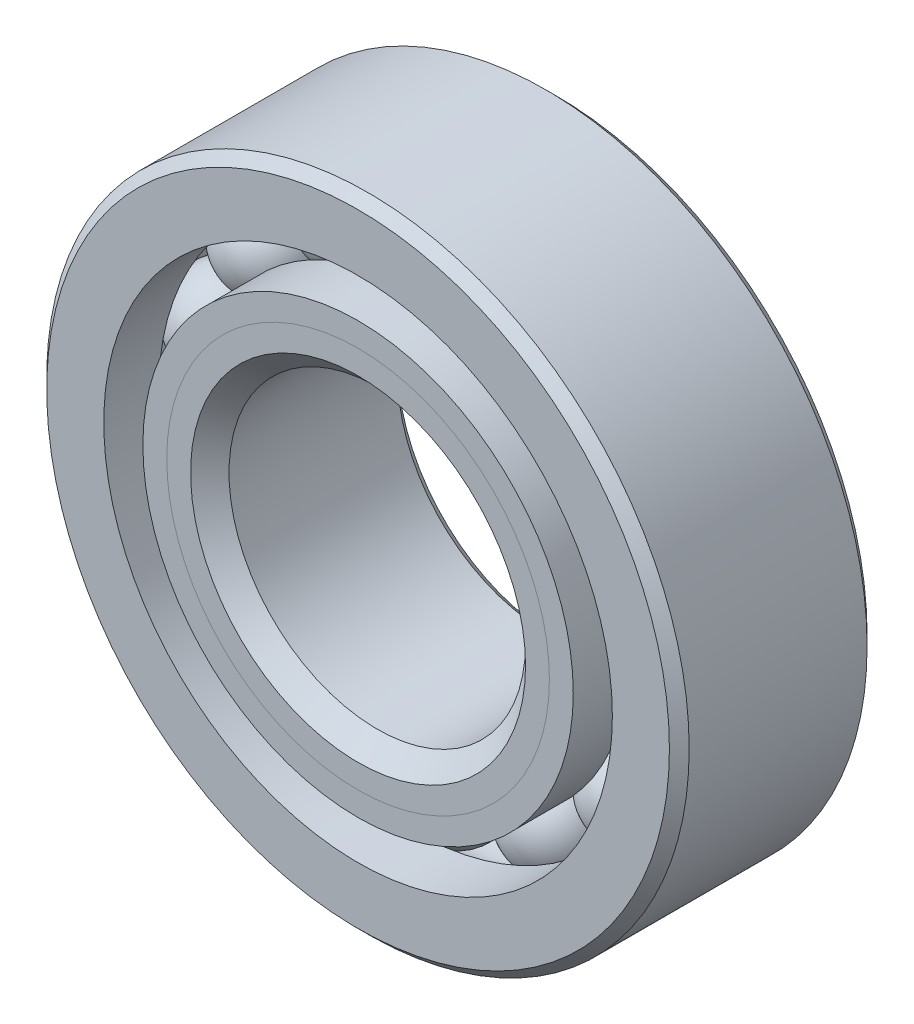
ISO-10303-21;
HEADER;
FILE_DESCRIPTION(('STEP AP214'),'2;1');
FILE_NAME('part.step','',(''),(''),'','','');
FILE_SCHEMA(('AUTOMOTIVE_DESIGN { 1 0 10303 214 1 1 1 1 }'));
ENDSEC;
DATA;
#1=APPLICATION_CONTEXT('core data for automotive mechanical design processes');
#2=APPLICATION_PROTOCOL_DEFINITION('international standard','automotive_design',2000,#1);
#3=PRODUCT_CONTEXT('',#1,'mechanical');
#4=PRODUCT('Part','Part','',(#3));
#5=PRODUCT_RELATED_PRODUCT_CATEGORY('part','',(#4));
#6=PRODUCT_DEFINITION_FORMATION('','',#4);
#7=PRODUCT_DEFINITION_CONTEXT('part definition',#1,'design');
#8=PRODUCT_DEFINITION('design','',#6,#7);
#9=PRODUCT_DEFINITION_SHAPE('','',#8);
#10=(LENGTH_UNIT() NAMED_UNIT(*) SI_UNIT(.MILLI.,.METRE.));
#11=(NAMED_UNIT(*) PLANE_ANGLE_UNIT() SI_UNIT($,.RADIAN.));
#12=(NAMED_UNIT(*) SI_UNIT($,.STERADIAN.) SOLID_ANGLE_UNIT());
#13=UNCERTAINTY_MEASURE_WITH_UNIT(LENGTH_MEASURE(1.E-05),#10,'distance_accuracy_value','');
#14=(GEOMETRIC_REPRESENTATION_CONTEXT(3) GLOBAL_UNCERTAINTY_ASSIGNED_CONTEXT((#13)) GLOBAL_UNIT_ASSIGNED_CONTEXT((#10,
#11,#12)) REPRESENTATION_CONTEXT('',''));
#15=CARTESIAN_POINT('',(0.,0.,0.));
#16=DIRECTION('',(0.,0.,1.));
#17=DIRECTION('',(1.,0.,0.));
#18=AXIS2_PLACEMENT_3D('',#15,#16,#17);
#19=CARTESIAN_POINT('',(-6.5435091405665,13.5877367390534,0.));
#20=DIRECTION('',(0.,0.,1.));
#21=DIRECTION('',(-0.433883739117546,0.900968867902425,0.));
#22=AXIS2_PLACEMENT_3D('',#19,#20,#21);
#23=SPHERICAL_SURFACE('',#22,3.08910742628344);
#24=CARTESIAN_POINT('',(-6.5435091405665,13.5877367390534,3.08910742628344));
#25=VERTEX_POINT('',#24);
#26=VERTEX_LOOP('',#25);
#27=FACE_BOUND('',#26,.T.);
#28=ADVANCED_FACE('F41',(#27),#23,.T.);
#29=CLOSED_SHELL('',(#28));
#30=MANIFOLD_SOLID_BREP('B2',#29);
#31=CARTESIAN_POINT('',(-11.7909960449709,9.40300557428217,0.));
#32=DIRECTION('',(0.,0.,1.));
#33=DIRECTION('',(-0.781831482468022,0.623489801858743,0.));
#34=AXIS2_PLACEMENT_3D('',#31,#32,#33);
#35=SPHERICAL_SURFACE('',#34,3.08910742628344);
#36=CARTESIAN_POINT('',(-11.7909960449709,9.40300557428217,3.08910742628344));
#37=VERTEX_POINT('',#36);
#38=VERTEX_LOOP('',#37);
#39=FACE_BOUND('',#38,.T.);
#40=ADVANCED_FACE('F72',(#39),#35,.T.);
#41=CLOSED_SHELL('',(#40));
#42=MANIFOLD_SOLID_BREP('B6',#41);
#43=CARTESIAN_POINT('',(-14.7031315755921,3.35589383522882,0.));
#44=DIRECTION('',(0.,0.,1.));
#45=DIRECTION('',(-0.974927912181821,0.222520933956325,0.));
#46=AXIS2_PLACEMENT_3D('',#43,#44,#45);
#47=SPHERICAL_SURFACE('',#46,3.08910742628344);
#48=CARTESIAN_POINT('',(-14.7031315755921,3.35589383522882,3.08910742628344));
#49=VERTEX_POINT('',#48);
#50=VERTEX_LOOP('',#49);
#51=FACE_BOUND('',#50,.T.);
#52=ADVANCED_FACE('F103',(#51),#47,.T.);
#53=CLOSED_SHELL('',(#52));
#54=MANIFOLD_SOLID_BREP('B37',#53);
#55=CARTESIAN_POINT('',(-14.7031315755922,-3.35589383522853,0.));
#56=DIRECTION('',(0.,0.,1.));
#57=DIRECTION('',(-0.974927912181826,-0.222520933956305,0.));
#58=AXIS2_PLACEMENT_3D('',#55,#56,#57);
#59=SPHERICAL_SURFACE('',#58,3.08910742628344);
#60=CARTESIAN_POINT('',(-14.7031315755922,-3.35589383522853,3.08910742628344));
#61=VERTEX_POINT('',#60);
#62=VERTEX_LOOP('',#61);
#63=FACE_BOUND('',#62,.T.);
#64=ADVANCED_FACE('F132',(#63),#59,.T.);
#65=CLOSED_SHELL('',(#64));
#66=MANIFOLD_SOLID_BREP('B68',#65);
#67=CARTESIAN_POINT('',(-11.7909960449711,-9.40300557428192,0.));
#68=DIRECTION('',(0.,0.,1.));
#69=DIRECTION('',(-0.781831482468035,-0.623489801858727,0.));
#70=AXIS2_PLACEMENT_3D('',#67,#68,#69);
#71=SPHERICAL_SURFACE('',#70,3.08910742628344);
#72=CARTESIAN_POINT('',(-11.7909960449711,-9.40300557428192,3.08910742628344));
#73=VERTEX_POINT('',#72);
#74=VERTEX_LOOP('',#73);
#75=FACE_BOUND('',#74,.T.);
#76=ADVANCED_FACE('F161',(#75),#71,.T.);
#77=CLOSED_SHELL('',(#76));
#78=MANIFOLD_SOLID_BREP('B99',#77);
#79=CARTESIAN_POINT('',(-6.54350914056678,-13.5877367390533,0.));
#80=DIRECTION('',(0.,0.,1.));
#81=DIRECTION('',(-0.433883739117565,-0.900968867902416,0.));
#82=AXIS2_PLACEMENT_3D('',#79,#80,#81);
#83=SPHERICAL_SURFACE('',#82,3.08910742628344);
#84=CARTESIAN_POINT('',(-6.54350914056678,-13.5877367390533,3.08910742628344));
#85=VERTEX_POINT('',#84);
#86=VERTEX_LOOP('',#85);
#87=FACE_BOUND('',#86,.T.);
#88=ADVANCED_FACE('F190',(#87),#83,.T.);
#89=CLOSED_SHELL('',(#88));
#90=MANIFOLD_SOLID_BREP('B128',#89);
#91=CARTESIAN_POINT('',(-1.05311866879462E-13,-15.08125,0.));
#92=DIRECTION('',(0.,0.,1.));
#93=DIRECTION('',(0.,-1.,0.));
#94=AXIS2_PLACEMENT_3D('',#91,#92,#93);
#95=SPHERICAL_SURFACE('',#94,3.08910742628344);
#96=CARTESIAN_POINT('',(-1.05311866879462E-13,-15.08125,3.08910742628344));
#97=VERTEX_POINT('',#96);
#98=VERTEX_LOOP('',#97);
#99=FACE_BOUND('',#98,.T.);
#100=ADVANCED_FACE('F221',(#99),#95,.T.);
#101=CLOSED_SHELL('',(#100));
#102=MANIFOLD_SOLID_BREP('B157',#101);
#103=CARTESIAN_POINT('',(6.54350914056659,-13.5877367390534,0.));
#104=DIRECTION('',(0.,0.,1.));
#105=DIRECTION('',(0.433883739117553,-0.900968867902422,0.));
#106=AXIS2_PLACEMENT_3D('',#103,#104,#105);
#107=SPHERICAL_SURFACE('',#106,3.08910742628344);
#108=CARTESIAN_POINT('',(6.54350914056659,-13.5877367390534,3.08910742628344));
#109=VERTEX_POINT('',#108);
#110=VERTEX_LOOP('',#109);
#111=FACE_BOUND('',#110,.T.);
#112=ADVANCED_FACE('F252',(#111),#107,.T.);
#113=CLOSED_SHELL('',(#112));
#114=MANIFOLD_SOLID_BREP('B186',#113);
#115=CARTESIAN_POINT('',(11.7909960449709,-9.40300557428208,0.));
#116=DIRECTION('',(0.,0.,1.));
#117=DIRECTION('',(0.781831482468027,-0.623489801858737,0.));
#118=AXIS2_PLACEMENT_3D('',#115,#116,#117);
#119=SPHERICAL_SURFACE('',#118,3.08910742628344);
#120=CARTESIAN_POINT('',(11.7909960449709,-9.40300557428208,3.08910742628344));
#121=VERTEX_POINT('',#120);
#122=VERTEX_LOOP('',#121);
#123=FACE_BOUND('',#122,.T.);
#124=ADVANCED_FACE('F283',(#123),#119,.T.);
#125=CLOSED_SHELL('',(#124));
#126=MANIFOLD_SOLID_BREP('B217',#125);
#127=CARTESIAN_POINT('',(14.7031315755921,-3.35589383522872,0.));
#128=DIRECTION('',(0.,0.,1.));
#129=DIRECTION('',(0.974927912181823,-0.222520933956318,0.));
#130=AXIS2_PLACEMENT_3D('',#127,#128,#129);
#131=SPHERICAL_SURFACE('',#130,3.08910742628344);
#132=CARTESIAN_POINT('',(14.7031315755921,-3.35589383522872,3.08910742628344));
#133=VERTEX_POINT('',#132);
#134=VERTEX_LOOP('',#133);
#135=FACE_BOUND('',#134,.T.);
#136=ADVANCED_FACE('F312',(#135),#131,.T.);
#137=CLOSED_SHELL('',(#136));
#138=MANIFOLD_SOLID_BREP('B248',#137);
#139=CARTESIAN_POINT('',(14.7031315755921,3.35589383522862,0.));
#140=DIRECTION('',(0.,0.,1.));
#141=DIRECTION('',(0.974927912181824,0.222520933956311,0.));
#142=AXIS2_PLACEMENT_3D('',#139,#140,#141);
#143=SPHERICAL_SURFACE('',#142,3.08910742628344);
#144=CARTESIAN_POINT('',(14.7031315755921,3.35589383522862,3.08910742628344));
#145=VERTEX_POINT('',#144);
#146=VERTEX_LOOP('',#145);
#147=FACE_BOUND('',#146,.T.);
#148=ADVANCED_FACE('F343',(#147),#143,.T.);
#149=CLOSED_SHELL('',(#148));
#150=MANIFOLD_SOLID_BREP('B279',#149);
#151=CARTESIAN_POINT('',(11.790996044971,9.403005574282,0.));
#152=DIRECTION('',(0.,0.,1.));
#153=DIRECTION('',(0.781831482468031,0.623489801858732,0.));
#154=AXIS2_PLACEMENT_3D('',#151,#152,#153);
#155=SPHERICAL_SURFACE('',#154,3.08910742628344);
#156=CARTESIAN_POINT('',(11.790996044971,9.403005574282,3.08910742628344));
#157=VERTEX_POINT('',#156);
#158=VERTEX_LOOP('',#157);
#159=FACE_BOUND('',#158,.T.);
#160=ADVANCED_FACE('F374',(#159),#155,.T.);
#161=CLOSED_SHELL('',(#160));
#162=MANIFOLD_SOLID_BREP('B308',#161);
#163=CARTESIAN_POINT('',(6.54350914056669,13.5877367390534,0.));
#164=DIRECTION('',(0.,0.,1.));
#165=DIRECTION('',(0.433883739117559,0.900968867902419,0.));
#166=AXIS2_PLACEMENT_3D('',#163,#164,#165);
#167=SPHERICAL_SURFACE('',#166,3.08910742628344);
#168=CARTESIAN_POINT('',(6.54350914056669,13.5877367390534,3.08910742628344));
#169=VERTEX_POINT('',#168);
#170=VERTEX_LOOP('',#169);
#171=FACE_BOUND('',#170,.T.);
#172=ADVANCED_FACE('F403',(#171),#167,.T.);
#173=CLOSED_SHELL('',(#172));
#174=MANIFOLD_SOLID_BREP('B339',#173);
#175=CARTESIAN_POINT('',(0.,15.08125,0.));
#176=DIRECTION('',(0.,0.,1.));
#177=DIRECTION('',(0.,1.,0.));
#178=AXIS2_PLACEMENT_3D('',#175,#176,#177);
#179=SPHERICAL_SURFACE('',#178,3.08910742628344);
#180=CARTESIAN_POINT('',(0.,15.08125,3.08910742628344));
#181=VERTEX_POINT('',#180);
#182=VERTEX_LOOP('',#181);
#183=FACE_BOUND('',#182,.T.);
#184=ADVANCED_FACE('F436',(#183),#179,.T.);
#185=CLOSED_SHELL('',(#184));
#186=MANIFOLD_SOLID_BREP('B370',#185);
#187=CARTESIAN_POINT('',(0.,12.2918886654072,6.35));
#188=DIRECTION('',(0.,0.,-1.));
#189=DIRECTION('',(-1.,0.,0.));
#190=AXIS2_PLACEMENT_3D('',#187,#188,#189);
#191=PLANE('',#190);
#192=CARTESIAN_POINT('',(0.,0.,6.35));
#193=DIRECTION('',(0.,0.,1.));
#194=DIRECTION('',(1.,0.,0.));
#195=AXIS2_PLACEMENT_3D('',#192,#193,#194);
#196=CIRCLE('',#195,10.7585712868583);
#197=CARTESIAN_POINT('',(10.7585712868583,0.,6.35));
#198=VERTEX_POINT('',#197);
#199=EDGE_CURVE('E490',#198,#198,#196,.T.);
#200=ORIENTED_EDGE('',*,*,#199,.F.);
#201=EDGE_LOOP('',(#200));
#202=FACE_BOUND('',#201,.T.);
#203=CARTESIAN_POINT('',(0.,0.,6.35));
#204=DIRECTION('',(0.,0.,1.));
#205=DIRECTION('',(1.,0.,0.));
#206=AXIS2_PLACEMENT_3D('',#203,#204,#205);
#207=CIRCLE('',#206,12.2918886654072);
#208=CARTESIAN_POINT('',(12.2918886654072,0.,6.35));
#209=VERTEX_POINT('',#208);
#210=EDGE_CURVE('E435',#209,#209,#207,.T.);
#211=ORIENTED_EDGE('',*,*,#210,.T.);
#212=EDGE_LOOP('',(#211));
#213=FACE_BOUND('',#212,.T.);
#214=ADVANCED_FACE('F456',(#202,#213),#191,.F.);
#215=CARTESIAN_POINT('',(0.,0.,4.81668262145113));
#216=DIRECTION('',(0.,0.,1.));
#217=DIRECTION('',(1.,0.,0.));
#218=AXIS2_PLACEMENT_3D('',#215,#216,#217);
#219=CONICAL_SURFACE('',#218,10.7585712868583,0.785398163397451);
#220=ORIENTED_EDGE('',*,*,#210,.F.);
#221=EDGE_LOOP('',(#220));
#222=FACE_BOUND('',#221,.T.);
#223=CARTESIAN_POINT('',(0.,0.,4.81668262145113));
#224=DIRECTION('',(0.,0.,1.));
#225=DIRECTION('',(1.,0.,0.));
#226=AXIS2_PLACEMENT_3D('',#223,#224,#225);
#227=CIRCLE('',#226,10.7585712868583);
#228=CARTESIAN_POINT('',(10.7585712868583,0.,4.81668262145113));
#229=VERTEX_POINT('',#228);
#230=EDGE_CURVE('E462',#229,#229,#227,.T.);
#231=ORIENTED_EDGE('',*,*,#230,.T.);
#232=EDGE_LOOP('',(#231));
#233=FACE_BOUND('',#232,.T.);
#234=ADVANCED_FACE('F497',(#222,#233),#219,.T.);
#235=CARTESIAN_POINT('',(0.,0.,6.35));
#236=DIRECTION('',(0.,0.,1.));
#237=DIRECTION('',(1.,0.,0.));
#238=AXIS2_PLACEMENT_3D('',#235,#236,#237);
#239=CYLINDRICAL_SURFACE('',#238,10.7585712868583);
#240=ORIENTED_EDGE('',*,*,#230,.F.);
#241=EDGE_LOOP('',(#240));
#242=FACE_BOUND('',#241,.T.);
#243=CARTESIAN_POINT('',(0.,0.,0.));
#244=DIRECTION('',(0.,0.,1.));
#245=DIRECTION('',(1.,0.,0.));
#246=AXIS2_PLACEMENT_3D('',#243,#244,#245);
#247=CIRCLE('',#246,10.7585712868583);
#248=CARTESIAN_POINT('',(10.7585712868583,0.,0.));
#249=VERTEX_POINT('',#248);
#250=EDGE_CURVE('E466',#249,#249,#247,.T.);
#251=ORIENTED_EDGE('',*,*,#250,.T.);
#252=EDGE_LOOP('',(#251));
#253=FACE_BOUND('',#252,.T.);
#254=ADVANCED_FACE('F501',(#242,#253),#239,.T.);
#255=CARTESIAN_POINT('',(0.,10.7585712868583,0.));
#256=DIRECTION('',(0.,0.,-1.));
#257=DIRECTION('',(-1.,0.,0.));
#258=AXIS2_PLACEMENT_3D('',#255,#256,#257);
#259=PLANE('',#258);
#260=ORIENTED_EDGE('',*,*,#250,.F.);
#261=EDGE_LOOP('',(#260));
#262=FACE_BOUND('',#261,.T.);
#263=CARTESIAN_POINT('',(0.,0.,0.));
#264=DIRECTION('',(0.,0.,1.));
#265=DIRECTION('',(1.,0.,0.));
#266=AXIS2_PLACEMENT_3D('',#263,#264,#265);
#267=CIRCLE('',#266,11.9921425737166);
#268=CARTESIAN_POINT('',(11.9921425737166,0.,0.));
#269=VERTEX_POINT('',#268);
#270=EDGE_CURVE('E470',#269,#269,#267,.T.);
#271=ORIENTED_EDGE('',*,*,#270,.T.);
#272=EDGE_LOOP('',(#271));
#273=FACE_BOUND('',#272,.T.);
#274=ADVANCED_FACE('F506',(#262,#273),#259,.F.);
#275=CARTESIAN_POINT('',(0.,0.,0.));
#276=DIRECTION('',(0.,0.,1.));
#277=DIRECTION('',(1.,0.,0.));
#278=AXIS2_PLACEMENT_3D('',#275,#276,#277);
#279=TOROIDAL_SURFACE('',#278,15.08125,3.08910742628344);
#280=ORIENTED_EDGE('',*,*,#270,.F.);
#281=EDGE_LOOP('',(#280));
#282=FACE_BOUND('',#281,.T.);
#283=CARTESIAN_POINT('',(0.,0.,-2.82222222222222));
#284=DIRECTION('',(0.,0.,1.));
#285=DIRECTION('',(1.,0.,0.));
#286=AXIS2_PLACEMENT_3D('',#283,#284,#285);
#287=CIRCLE('',#286,13.825206043956);
#288=CARTESIAN_POINT('',(13.825206043956,0.,-2.82222222222222));
#289=VERTEX_POINT('',#288);
#290=EDGE_CURVE('E475',#289,#289,#287,.T.);
#291=ORIENTED_EDGE('',*,*,#290,.T.);
#292=EDGE_LOOP('',(#291));
#293=FACE_BOUND('',#292,.T.);
#294=ADVANCED_FACE('F512',(#282,#293),#279,.F.);
#295=CARTESIAN_POINT('',(0.,0.,6.35));
#296=DIRECTION('',(0.,0.,1.));
#297=DIRECTION('',(1.,0.,0.));
#298=AXIS2_PLACEMENT_3D('',#295,#296,#297);
#299=CYLINDRICAL_SURFACE('',#298,13.825206043956);
#300=ORIENTED_EDGE('',*,*,#290,.F.);
#301=EDGE_LOOP('',(#300));
#302=FACE_BOUND('',#301,.T.);
#303=CARTESIAN_POINT('',(0.,0.,-6.35));
#304=DIRECTION('',(0.,0.,1.));
#305=DIRECTION('',(1.,0.,0.));
#306=AXIS2_PLACEMENT_3D('',#303,#304,#305);
#307=CIRCLE('',#306,13.825206043956);
#308=CARTESIAN_POINT('',(13.825206043956,0.,-6.35));
#309=VERTEX_POINT('',#308);
#310=EDGE_CURVE('E478',#309,#309,#307,.T.);
#311=ORIENTED_EDGE('',*,*,#310,.T.);
#312=EDGE_LOOP('',(#311));
#313=FACE_BOUND('',#312,.T.);
#314=ADVANCED_FACE('F516',(#302,#313),#299,.T.);
#315=CARTESIAN_POINT('',(0.,10.16,-6.35));
#316=DIRECTION('',(0.,0.,1.));
#317=DIRECTION('',(1.,0.,0.));
#318=AXIS2_PLACEMENT_3D('',#315,#316,#317);
#319=PLANE('',#318);
#320=ORIENTED_EDGE('',*,*,#310,.F.);
#321=EDGE_LOOP('',(#320));
#322=FACE_BOUND('',#321,.T.);
#323=CARTESIAN_POINT('',(0.,0.,-6.35));
#324=DIRECTION('',(0.,0.,1.));
#325=DIRECTION('',(1.,0.,0.));
#326=AXIS2_PLACEMENT_3D('',#323,#324,#325);
#327=CIRCLE('',#326,10.16);
#328=CARTESIAN_POINT('',(10.16,0.,-6.35));
#329=VERTEX_POINT('',#328);
#330=EDGE_CURVE('E481',#329,#329,#327,.T.);
#331=ORIENTED_EDGE('',*,*,#330,.T.);
#332=EDGE_LOOP('',(#331));
#333=FACE_BOUND('',#332,.T.);
#334=ADVANCED_FACE('F520',(#322,#333),#319,.F.);
#335=CARTESIAN_POINT('',(0.,0.,-5.715));
#336=DIRECTION('',(0.,0.,-1.));
#337=DIRECTION('',(-1.,0.,0.));
#338=AXIS2_PLACEMENT_3D('',#335,#336,#337);
#339=CONICAL_SURFACE('',#338,9.525,0.78539816339745);
#340=ORIENTED_EDGE('',*,*,#330,.F.);
#341=EDGE_LOOP('',(#340));
#342=FACE_BOUND('',#341,.T.);
#343=CARTESIAN_POINT('',(0.,0.,-5.715));
#344=DIRECTION('',(0.,0.,1.));
#345=DIRECTION('',(1.,0.,0.));
#346=AXIS2_PLACEMENT_3D('',#343,#344,#345);
#347=CIRCLE('',#346,9.525);
#348=CARTESIAN_POINT('',(9.525,0.,-5.715));
#349=VERTEX_POINT('',#348);
#350=EDGE_CURVE('E484',#349,#349,#347,.T.);
#351=ORIENTED_EDGE('',*,*,#350,.T.);
#352=EDGE_LOOP('',(#351));
#353=FACE_BOUND('',#352,.T.);
#354=ADVANCED_FACE('F524',(#342,#353),#339,.F.);
#355=CARTESIAN_POINT('',(0.,0.,6.35));
#356=DIRECTION('',(0.,0.,1.));
#357=DIRECTION('',(1.,0.,0.));
#358=AXIS2_PLACEMENT_3D('',#355,#356,#357);
#359=CYLINDRICAL_SURFACE('',#358,9.525);
#360=ORIENTED_EDGE('',*,*,#350,.F.);
#361=EDGE_LOOP('',(#360));
#362=FACE_BOUND('',#361,.T.);
#363=CARTESIAN_POINT('',(0.,0.,5.11642871314173));
#364=DIRECTION('',(0.,0.,1.));
#365=DIRECTION('',(1.,0.,0.));
#366=AXIS2_PLACEMENT_3D('',#363,#364,#365);
#367=CIRCLE('',#366,9.525);
#368=CARTESIAN_POINT('',(9.525,0.,5.11642871314173));
#369=VERTEX_POINT('',#368);
#370=EDGE_CURVE('E487',#369,#369,#367,.T.);
#371=ORIENTED_EDGE('',*,*,#370,.T.);
#372=EDGE_LOOP('',(#371));
#373=FACE_BOUND('',#372,.T.);
#374=ADVANCED_FACE('F528',(#362,#373),#359,.F.);
#375=CARTESIAN_POINT('',(0.,0.,6.35));
#376=DIRECTION('',(0.,0.,1.));
#377=DIRECTION('',(1.,0.,0.));
#378=AXIS2_PLACEMENT_3D('',#375,#376,#377);
#379=CONICAL_SURFACE('',#378,10.7585712868583,0.78539816339745);
#380=ORIENTED_EDGE('',*,*,#370,.F.);
#381=EDGE_LOOP('',(#380));
#382=FACE_BOUND('',#381,.T.);
#383=ORIENTED_EDGE('',*,*,#199,.T.);
#384=EDGE_LOOP('',(#383));
#385=FACE_BOUND('',#384,.T.);
#386=ADVANCED_FACE('F494',(#382,#385),#379,.F.);
#387=CLOSED_SHELL('',(#214,#234,#254,#274,#294,#314,#334,#354,#374,#386));
#388=MANIFOLD_SOLID_BREP('B399',#387);
#389=CARTESIAN_POINT('',(0.,13.825206043956,6.35));
#390=DIRECTION('',(0.,0.,-1.));
#391=DIRECTION('',(-1.,0.,0.));
#392=AXIS2_PLACEMENT_3D('',#389,#390,#391);
#393=PLANE('',#392);
#394=CARTESIAN_POINT('',(0.,0.,6.35));
#395=DIRECTION('',(0.,0.,1.));
#396=DIRECTION('',(1.,0.,0.));
#397=AXIS2_PLACEMENT_3D('',#394,#395,#396);
#398=CIRCLE('',#397,12.2918886654072);
#399=CARTESIAN_POINT('',(12.2918886654072,0.,6.35));
#400=VERTEX_POINT('',#399);
#401=EDGE_CURVE('E455',#400,#400,#398,.T.);
#402=ORIENTED_EDGE('',*,*,#401,.F.);
#403=EDGE_LOOP('',(#402));
#404=FACE_BOUND('',#403,.T.);
#405=CARTESIAN_POINT('',(0.,0.,6.35));
#406=DIRECTION('',(0.,0.,1.));
#407=DIRECTION('',(1.,0.,0.));
#408=AXIS2_PLACEMENT_3D('',#405,#406,#407);
#409=CIRCLE('',#408,13.825206043956);
#410=CARTESIAN_POINT('',(13.825206043956,0.,6.35));
#411=VERTEX_POINT('',#410);
#412=EDGE_CURVE('E636',#411,#411,#409,.T.);
#413=ORIENTED_EDGE('',*,*,#412,.T.);
#414=EDGE_LOOP('',(#413));
#415=FACE_BOUND('',#414,.T.);
#416=ADVANCED_FACE('F614',(#404,#415),#393,.F.);
#417=CARTESIAN_POINT('',(0.,0.,6.35));
#418=DIRECTION('',(0.,0.,1.));
#419=DIRECTION('',(1.,0.,0.));
#420=AXIS2_PLACEMENT_3D('',#417,#418,#419);
#421=CONICAL_SURFACE('',#420,12.2918886654072,0.785398163397451);
#422=CARTESIAN_POINT('',(0.,0.,4.81668262145113));
#423=DIRECTION('',(0.,0.,1.));
#424=DIRECTION('',(1.,0.,0.));
#425=AXIS2_PLACEMENT_3D('',#422,#423,#424);
#426=CIRCLE('',#425,10.7585712868583);
#427=CARTESIAN_POINT('',(10.7585712868583,0.,4.81668262145113));
#428=VERTEX_POINT('',#427);
#429=EDGE_CURVE('E620',#428,#428,#426,.T.);
#430=ORIENTED_EDGE('',*,*,#429,.F.);
#431=EDGE_LOOP('',(#430));
#432=FACE_BOUND('',#431,.T.);
#433=ORIENTED_EDGE('',*,*,#401,.T.);
#434=EDGE_LOOP('',(#433));
#435=FACE_BOUND('',#434,.T.);
#436=ADVANCED_FACE('F661',(#432,#435),#421,.F.);
#437=CARTESIAN_POINT('',(0.,0.,6.35));
#438=DIRECTION('',(0.,0.,1.));
#439=DIRECTION('',(1.,0.,0.));
#440=AXIS2_PLACEMENT_3D('',#437,#438,#439);
#441=CYLINDRICAL_SURFACE('',#440,10.7585712868583);
#442=CARTESIAN_POINT('',(0.,0.,0.));
#443=DIRECTION('',(0.,0.,1.));
#444=DIRECTION('',(1.,0.,0.));
#445=AXIS2_PLACEMENT_3D('',#442,#443,#444);
#446=CIRCLE('',#445,10.7585712868583);
#447=CARTESIAN_POINT('',(10.7585712868583,0.,0.));
#448=VERTEX_POINT('',#447);
#449=EDGE_CURVE('E624',#448,#448,#446,.T.);
#450=ORIENTED_EDGE('',*,*,#449,.F.);
#451=EDGE_LOOP('',(#450));
#452=FACE_BOUND('',#451,.T.);
#453=ORIENTED_EDGE('',*,*,#429,.T.);
#454=EDGE_LOOP('',(#453));
#455=FACE_BOUND('',#454,.T.);
#456=ADVANCED_FACE('F656',(#452,#455),#441,.F.);
#457=CARTESIAN_POINT('',(0.,10.7585712868583,0.));
#458=DIRECTION('',(0.,0.,1.));
#459=DIRECTION('',(1.,0.,0.));
#460=AXIS2_PLACEMENT_3D('',#457,#458,#459);
#461=PLANE('',#460);
#462=CARTESIAN_POINT('',(0.,0.,0.));
#463=DIRECTION('',(0.,0.,1.));
#464=DIRECTION('',(1.,0.,0.));
#465=AXIS2_PLACEMENT_3D('',#462,#463,#464);
#466=CIRCLE('',#465,11.9921425737166);
#467=CARTESIAN_POINT('',(11.9921425737166,0.,0.));
#468=VERTEX_POINT('',#467);
#469=EDGE_CURVE('E628',#468,#468,#466,.T.);
#470=ORIENTED_EDGE('',*,*,#469,.F.);
#471=EDGE_LOOP('',(#470));
#472=FACE_BOUND('',#471,.T.);
#473=ORIENTED_EDGE('',*,*,#449,.T.);
#474=EDGE_LOOP('',(#473));
#475=FACE_BOUND('',#474,.T.);
#476=ADVANCED_FACE('F650',(#472,#475),#461,.F.);
#477=CARTESIAN_POINT('',(0.,0.,0.));
#478=DIRECTION('',(0.,0.,1.));
#479=DIRECTION('',(1.,0.,0.));
#480=AXIS2_PLACEMENT_3D('',#477,#478,#479);
#481=TOROIDAL_SURFACE('',#480,15.08125,3.08910742628344);
#482=CARTESIAN_POINT('',(0.,0.,2.82222222222222));
#483=DIRECTION('',(0.,0.,1.));
#484=DIRECTION('',(1.,0.,0.));
#485=AXIS2_PLACEMENT_3D('',#482,#483,#484);
#486=CIRCLE('',#485,13.825206043956);
#487=CARTESIAN_POINT('',(13.825206043956,0.,2.82222222222222));
#488=VERTEX_POINT('',#487);
#489=EDGE_CURVE('E633',#488,#488,#486,.T.);
#490=ORIENTED_EDGE('',*,*,#489,.F.);
#491=EDGE_LOOP('',(#490));
#492=FACE_BOUND('',#491,.T.);
#493=ORIENTED_EDGE('',*,*,#469,.T.);
#494=EDGE_LOOP('',(#493));
#495=FACE_BOUND('',#494,.T.);
#496=ADVANCED_FACE('F644',(#492,#495),#481,.F.);
#497=CARTESIAN_POINT('',(0.,0.,6.35));
#498=DIRECTION('',(0.,0.,1.));
#499=DIRECTION('',(1.,0.,0.));
#500=AXIS2_PLACEMENT_3D('',#497,#498,#499);
#501=CYLINDRICAL_SURFACE('',#500,13.825206043956);
#502=ORIENTED_EDGE('',*,*,#412,.F.);
#503=EDGE_LOOP('',(#502));
#504=FACE_BOUND('',#503,.T.);
#505=ORIENTED_EDGE('',*,*,#489,.T.);
#506=EDGE_LOOP('',(#505));
#507=FACE_BOUND('',#506,.T.);
#508=ADVANCED_FACE('F641',(#504,#507),#501,.T.);
#509=CLOSED_SHELL('',(#416,#436,#456,#476,#496,#508));
#510=MANIFOLD_SOLID_BREP('B430',#509);
#511=CARTESIAN_POINT('',(0.,0.,5.715));
#512=DIRECTION('',(0.,0.,-1.));
#513=DIRECTION('',(-1.,0.,0.));
#514=AXIS2_PLACEMENT_3D('',#511,#512,#513);
#515=CONICAL_SURFACE('',#514,20.6375,0.785398163397446);
#516=CARTESIAN_POINT('',(0.,0.,6.35));
#517=DIRECTION('',(0.,0.,1.));
#518=DIRECTION('',(1.,0.,0.));
#519=AXIS2_PLACEMENT_3D('',#516,#517,#518);
#520=CIRCLE('',#519,20.0025);
#521=CARTESIAN_POINT('',(20.0025,0.,6.35));
#522=VERTEX_POINT('',#521);
#523=EDGE_CURVE('E733',#522,#522,#520,.T.);
#524=ORIENTED_EDGE('',*,*,#523,.F.);
#525=EDGE_LOOP('',(#524));
#526=FACE_BOUND('',#525,.T.);
#527=CARTESIAN_POINT('',(0.,0.,5.715));
#528=DIRECTION('',(0.,0.,1.));
#529=DIRECTION('',(1.,0.,0.));
#530=AXIS2_PLACEMENT_3D('',#527,#528,#529);
#531=CIRCLE('',#530,20.6375);
#532=CARTESIAN_POINT('',(20.6375,0.,5.715));
#533=VERTEX_POINT('',#532);
#534=EDGE_CURVE('E613',#533,#533,#531,.T.);
#535=ORIENTED_EDGE('',*,*,#534,.T.);
#536=EDGE_LOOP('',(#535));
#537=FACE_BOUND('',#536,.T.);
#538=ADVANCED_FACE('F705',(#526,#537),#515,.T.);
#539=CARTESIAN_POINT('',(0.,0.,6.35));
#540=DIRECTION('',(0.,0.,1.));
#541=DIRECTION('',(1.,0.,0.));
#542=AXIS2_PLACEMENT_3D('',#539,#540,#541);
#543=CYLINDRICAL_SURFACE('',#542,20.6375);
#544=ORIENTED_EDGE('',*,*,#534,.F.);
#545=EDGE_LOOP('',(#544));
#546=FACE_BOUND('',#545,.T.);
#547=CARTESIAN_POINT('',(0.,0.,-5.715));
#548=DIRECTION('',(0.,0.,1.));
#549=DIRECTION('',(1.,0.,0.));
#550=AXIS2_PLACEMENT_3D('',#547,#548,#549);
#551=CIRCLE('',#550,20.6375);
#552=CARTESIAN_POINT('',(20.6375,0.,-5.715));
#553=VERTEX_POINT('',#552);
#554=EDGE_CURVE('E711',#553,#553,#551,.T.);
#555=ORIENTED_EDGE('',*,*,#554,.T.);
#556=EDGE_LOOP('',(#555));
#557=FACE_BOUND('',#556,.T.);
#558=ADVANCED_FACE('F740',(#546,#557),#543,.T.);
#559=CARTESIAN_POINT('',(0.,0.,-6.35));
#560=DIRECTION('',(0.,0.,1.));
#561=DIRECTION('',(1.,0.,0.));
#562=AXIS2_PLACEMENT_3D('',#559,#560,#561);
#563=CONICAL_SURFACE('',#562,20.0025,0.785398163397446);
#564=ORIENTED_EDGE('',*,*,#554,.F.);
#565=EDGE_LOOP('',(#564));
#566=FACE_BOUND('',#565,.T.);
#567=CARTESIAN_POINT('',(0.,0.,-6.35));
#568=DIRECTION('',(0.,0.,1.));
#569=DIRECTION('',(1.,0.,0.));
#570=AXIS2_PLACEMENT_3D('',#567,#568,#569);
#571=CIRCLE('',#570,20.0025);
#572=CARTESIAN_POINT('',(20.0025,0.,-6.35));
#573=VERTEX_POINT('',#572);
#574=EDGE_CURVE('E715',#573,#573,#571,.T.);
#575=ORIENTED_EDGE('',*,*,#574,.T.);
#576=EDGE_LOOP('',(#575));
#577=FACE_BOUND('',#576,.T.);
#578=ADVANCED_FACE('F744',(#566,#577),#563,.T.);
#579=CARTESIAN_POINT('',(0.,20.0025,-6.35));
#580=DIRECTION('',(0.,0.,1.));
#581=DIRECTION('',(1.,0.,0.));
#582=AXIS2_PLACEMENT_3D('',#579,#580,#581);
#583=PLANE('',#582);
#584=ORIENTED_EDGE('',*,*,#574,.F.);
#585=EDGE_LOOP('',(#584));
#586=FACE_BOUND('',#585,.T.);
#587=CARTESIAN_POINT('',(0.,0.,-6.35));
#588=DIRECTION('',(0.,0.,1.));
#589=DIRECTION('',(1.,0.,0.));
#590=AXIS2_PLACEMENT_3D('',#587,#588,#589);
#591=CIRCLE('',#590,16.337293956044);
#592=CARTESIAN_POINT('',(16.337293956044,0.,-6.35));
#593=VERTEX_POINT('',#592);
#594=EDGE_CURVE('E719',#593,#593,#591,.T.);
#595=ORIENTED_EDGE('',*,*,#594,.T.);
#596=EDGE_LOOP('',(#595));
#597=FACE_BOUND('',#596,.T.);
#598=ADVANCED_FACE('F749',(#586,#597),#583,.F.);
#599=CARTESIAN_POINT('',(0.,0.,6.35));
#600=DIRECTION('',(0.,0.,1.));
#601=DIRECTION('',(1.,0.,0.));
#602=AXIS2_PLACEMENT_3D('',#599,#600,#601);
#603=CYLINDRICAL_SURFACE('',#602,16.337293956044);
#604=ORIENTED_EDGE('',*,*,#594,.F.);
#605=EDGE_LOOP('',(#604));
#606=FACE_BOUND('',#605,.T.);
#607=CARTESIAN_POINT('',(0.,0.,-2.82222222222222));
#608=DIRECTION('',(0.,0.,1.));
#609=DIRECTION('',(1.,0.,0.));
#610=AXIS2_PLACEMENT_3D('',#607,#608,#609);
#611=CIRCLE('',#610,16.337293956044);
#612=CARTESIAN_POINT('',(16.337293956044,0.,-2.82222222222222));
#613=VERTEX_POINT('',#612);
#614=EDGE_CURVE('E724',#613,#613,#611,.T.);
#615=ORIENTED_EDGE('',*,*,#614,.T.);
#616=EDGE_LOOP('',(#615));
#617=FACE_BOUND('',#616,.T.);
#618=ADVANCED_FACE('F755',(#606,#617),#603,.F.);
#619=CARTESIAN_POINT('',(0.,0.,0.));
#620=DIRECTION('',(0.,0.,1.));
#621=DIRECTION('',(1.,0.,0.));
#622=AXIS2_PLACEMENT_3D('',#619,#620,#621);
#623=TOROIDAL_SURFACE('',#622,15.08125,3.08910742628344);
#624=ORIENTED_EDGE('',*,*,#614,.F.);
#625=EDGE_LOOP('',(#624));
#626=FACE_BOUND('',#625,.T.);
#627=CARTESIAN_POINT('',(0.,0.,2.82222222222222));
#628=DIRECTION('',(0.,0.,1.));
#629=DIRECTION('',(1.,0.,0.));
#630=AXIS2_PLACEMENT_3D('',#627,#628,#629);
#631=CIRCLE('',#630,16.337293956044);
#632=CARTESIAN_POINT('',(16.337293956044,0.,2.82222222222222));
#633=VERTEX_POINT('',#632);
#634=EDGE_CURVE('E727',#633,#633,#631,.T.);
#635=ORIENTED_EDGE('',*,*,#634,.T.);
#636=EDGE_LOOP('',(#635));
#637=FACE_BOUND('',#636,.T.);
#638=ADVANCED_FACE('F759',(#626,#637),#623,.F.);
#639=CARTESIAN_POINT('',(0.,0.,6.35));
#640=DIRECTION('',(0.,0.,1.));
#641=DIRECTION('',(1.,0.,0.));
#642=AXIS2_PLACEMENT_3D('',#639,#640,#641);
#643=CYLINDRICAL_SURFACE('',#642,16.337293956044);
#644=ORIENTED_EDGE('',*,*,#634,.F.);
#645=EDGE_LOOP('',(#644));
#646=FACE_BOUND('',#645,.T.);
#647=CARTESIAN_POINT('',(0.,0.,6.35));
#648=DIRECTION('',(0.,0.,1.));
#649=DIRECTION('',(1.,0.,0.));
#650=AXIS2_PLACEMENT_3D('',#647,#648,#649);
#651=CIRCLE('',#650,16.337293956044);
#652=CARTESIAN_POINT('',(16.337293956044,0.,6.35));
#653=VERTEX_POINT('',#652);
#654=EDGE_CURVE('E730',#653,#653,#651,.T.);
#655=ORIENTED_EDGE('',*,*,#654,.T.);
#656=EDGE_LOOP('',(#655));
#657=FACE_BOUND('',#656,.T.);
#658=ADVANCED_FACE('F763',(#646,#657),#643,.F.);
#659=CARTESIAN_POINT('',(0.,20.0025,6.35));
#660=DIRECTION('',(0.,0.,-1.));
#661=DIRECTION('',(-1.,0.,0.));
#662=AXIS2_PLACEMENT_3D('',#659,#660,#661);
#663=PLANE('',#662);
#664=ORIENTED_EDGE('',*,*,#654,.F.);
#665=EDGE_LOOP('',(#664));
#666=FACE_BOUND('',#665,.T.);
#667=ORIENTED_EDGE('',*,*,#523,.T.);
#668=EDGE_LOOP('',(#667));
#669=FACE_BOUND('',#668,.T.);
#670=ADVANCED_FACE('F737',(#666,#669),#663,.F.);
#671=CLOSED_SHELL('',(#538,#558,#578,#598,#618,#638,#658,#670));
#672=MANIFOLD_SOLID_BREP('B450',#671);
#673=ADVANCED_BREP_SHAPE_REPRESENTATION('',(#18,#30,#42,#54,#66,#78,#90,#102,#114,#126,#138,
#150,#162,#174,#186,#388,#510,#672),#14);
#674=SHAPE_DEFINITION_REPRESENTATION(#9,#673);
ENDSEC;
END-ISO-10303-21;
